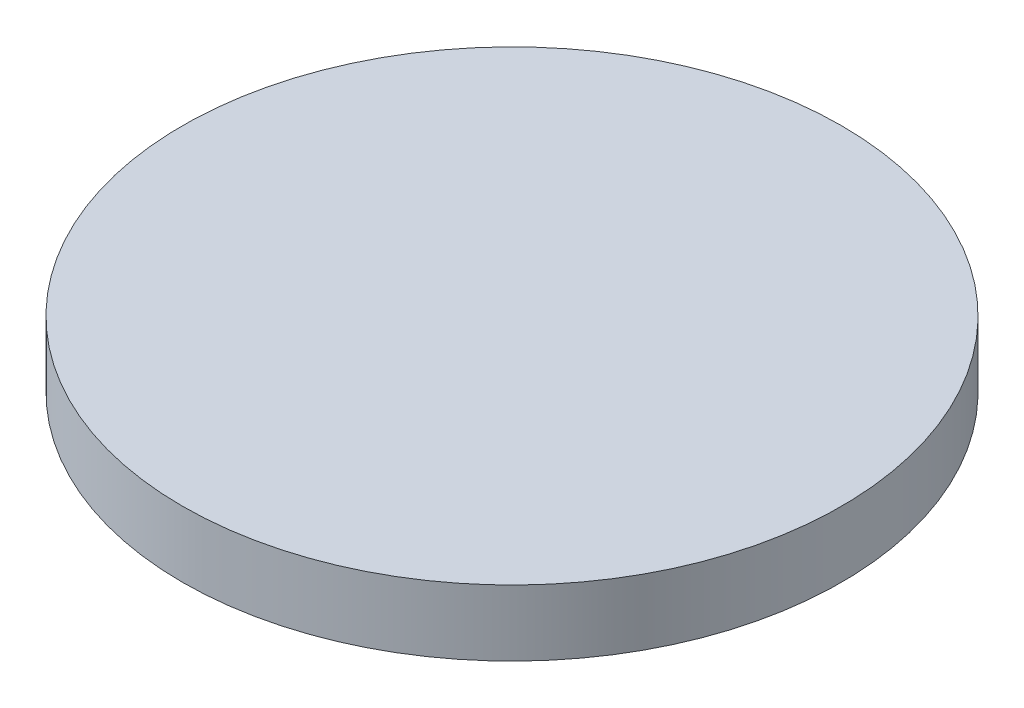
ISO-10303-21;
HEADER;
FILE_DESCRIPTION(('STEP AP214'),'2;1');
FILE_NAME('part.step','',(''),(''),'','','');
FILE_SCHEMA(('AUTOMOTIVE_DESIGN { 1 0 10303 214 1 1 1 1 }'));
ENDSEC;
DATA;
#1=APPLICATION_CONTEXT('core data for automotive mechanical design processes');
#2=APPLICATION_PROTOCOL_DEFINITION('international standard','automotive_design',2000,#1);
#3=PRODUCT_CONTEXT('',#1,'mechanical');
#4=PRODUCT('Part','Part','',(#3));
#5=PRODUCT_RELATED_PRODUCT_CATEGORY('part','',(#4));
#6=PRODUCT_DEFINITION_FORMATION('','',#4);
#7=PRODUCT_DEFINITION_CONTEXT('part definition',#1,'design');
#8=PRODUCT_DEFINITION('design','',#6,#7);
#9=PRODUCT_DEFINITION_SHAPE('','',#8);
#10=(LENGTH_UNIT() NAMED_UNIT(*) SI_UNIT(.MILLI.,.METRE.));
#11=(NAMED_UNIT(*) PLANE_ANGLE_UNIT() SI_UNIT($,.RADIAN.));
#12=(NAMED_UNIT(*) SI_UNIT($,.STERADIAN.) SOLID_ANGLE_UNIT());
#13=UNCERTAINTY_MEASURE_WITH_UNIT(LENGTH_MEASURE(1.E-05),#10,'distance_accuracy_value','');
#14=(GEOMETRIC_REPRESENTATION_CONTEXT(3) GLOBAL_UNCERTAINTY_ASSIGNED_CONTEXT((#13)) GLOBAL_UNIT_ASSIGNED_CONTEXT((#10,
#11,#12)) REPRESENTATION_CONTEXT('',''));
#15=CARTESIAN_POINT('',(0.,0.,0.));
#16=DIRECTION('',(0.,0.,1.));
#17=DIRECTION('',(1.,0.,0.));
#18=AXIS2_PLACEMENT_3D('',#15,#16,#17);
#19=CARTESIAN_POINT('',(0.,0.1,0.));
#20=DIRECTION('',(0.,1.,0.));
#21=DIRECTION('',(0.,0.,1.));
#22=AXIS2_PLACEMENT_3D('',#19,#20,#21);
#23=PLANE('',#22);
#24=CARTESIAN_POINT('',(0.,0.1,0.));
#25=DIRECTION('',(0.,1.,0.));
#26=DIRECTION('',(0.,0.,1.));
#27=AXIS2_PLACEMENT_3D('',#24,#25,#26);
#28=CIRCLE('',#27,0.5);
#29=CARTESIAN_POINT('',(0.,0.1,0.5));
#30=VERTEX_POINT('',#29);
#31=EDGE_CURVE('E17',#30,#30,#28,.F.);
#32=ORIENTED_EDGE('',*,*,#31,.F.);
#33=EDGE_LOOP('',(#32));
#34=FACE_BOUND('',#33,.T.);
#35=ADVANCED_FACE('F14',(#34),#23,.T.);
#36=CARTESIAN_POINT('',(0.,0.,0.));
#37=DIRECTION('',(0.,1.,0.));
#38=DIRECTION('',(0.,0.,1.));
#39=AXIS2_PLACEMENT_3D('',#36,#37,#38);
#40=CYLINDRICAL_SURFACE('',#39,0.5);
#41=CARTESIAN_POINT('',(0.,0.,0.));
#42=DIRECTION('',(0.,1.,0.));
#43=DIRECTION('',(0.,0.,1.));
#44=AXIS2_PLACEMENT_3D('',#41,#42,#43);
#45=CIRCLE('',#44,0.5);
#46=CARTESIAN_POINT('',(0.,0.,0.5));
#47=VERTEX_POINT('',#46);
#48=EDGE_CURVE('E9',#47,#47,#45,.T.);
#49=ORIENTED_EDGE('',*,*,#48,.T.);
#50=EDGE_LOOP('',(#49));
#51=FACE_BOUND('',#50,.T.);
#52=ORIENTED_EDGE('',*,*,#31,.T.);
#53=EDGE_LOOP('',(#52));
#54=FACE_BOUND('',#53,.T.);
#55=ADVANCED_FACE('F26',(#51,#54),#40,.T.);
#56=CARTESIAN_POINT('',(0.,0.,0.));
#57=DIRECTION('',(0.,1.,0.));
#58=DIRECTION('',(0.,0.,1.));
#59=AXIS2_PLACEMENT_3D('',#56,#57,#58);
#60=PLANE('',#59);
#61=ORIENTED_EDGE('',*,*,#48,.F.);
#62=EDGE_LOOP('',(#61));
#63=FACE_BOUND('',#62,.T.);
#64=ADVANCED_FACE('F33',(#63),#60,.F.);
#65=CLOSED_SHELL('',(#35,#55,#64));
#66=MANIFOLD_SOLID_BREP('B1',#65);
#67=ADVANCED_BREP_SHAPE_REPRESENTATION('',(#18,#66),#14);
#68=SHAPE_DEFINITION_REPRESENTATION(#9,#67);
ENDSEC;
END-ISO-10303-21;
